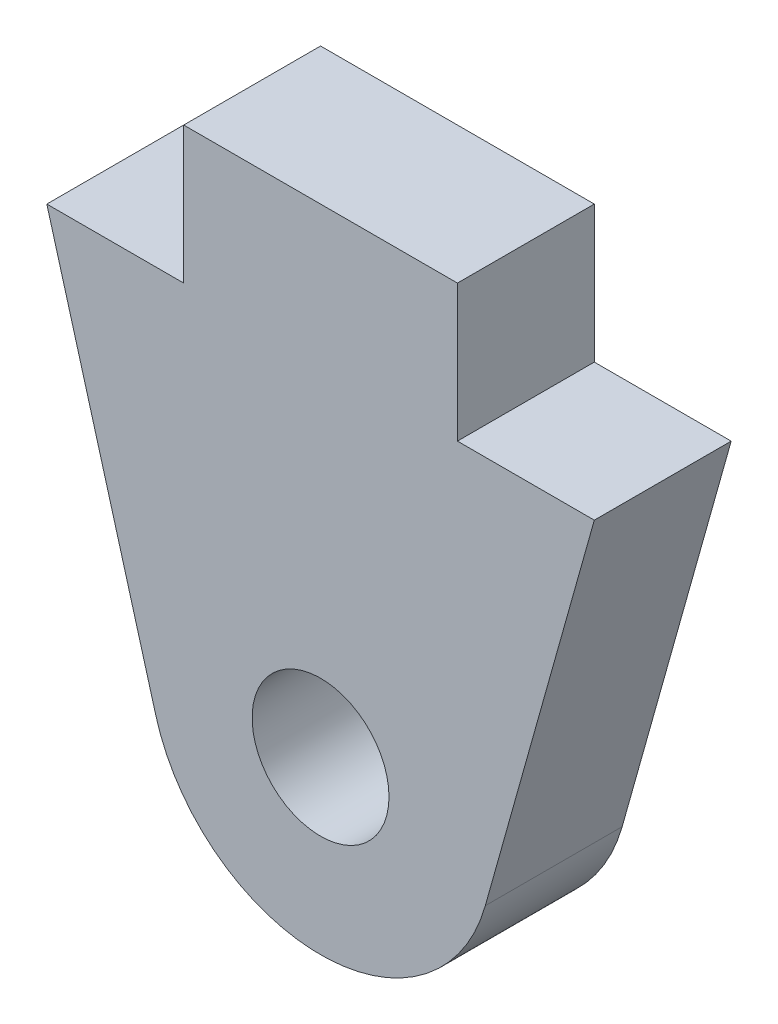
ISO-10303-21;
HEADER;
FILE_DESCRIPTION(('STEP AP214'),'2;1');
FILE_NAME('part.step','',(''),(''),'','','');
FILE_SCHEMA(('AUTOMOTIVE_DESIGN { 1 0 10303 214 1 1 1 1 }'));
ENDSEC;
DATA;
#1=APPLICATION_CONTEXT('core data for automotive mechanical design processes');
#2=APPLICATION_PROTOCOL_DEFINITION('international standard','automotive_design',2000,#1);
#3=PRODUCT_CONTEXT('',#1,'mechanical');
#4=PRODUCT('Part','Part','',(#3));
#5=PRODUCT_RELATED_PRODUCT_CATEGORY('part','',(#4));
#6=PRODUCT_DEFINITION_FORMATION('','',#4);
#7=PRODUCT_DEFINITION_CONTEXT('part definition',#1,'design');
#8=PRODUCT_DEFINITION('design','',#6,#7);
#9=PRODUCT_DEFINITION_SHAPE('','',#8);
#10=(LENGTH_UNIT() NAMED_UNIT(*) SI_UNIT(.MILLI.,.METRE.));
#11=(NAMED_UNIT(*) PLANE_ANGLE_UNIT() SI_UNIT($,.RADIAN.));
#12=(NAMED_UNIT(*) SI_UNIT($,.STERADIAN.) SOLID_ANGLE_UNIT());
#13=UNCERTAINTY_MEASURE_WITH_UNIT(LENGTH_MEASURE(1.E-05),#10,'distance_accuracy_value','');
#14=(GEOMETRIC_REPRESENTATION_CONTEXT(3) GLOBAL_UNCERTAINTY_ASSIGNED_CONTEXT((#13)) GLOBAL_UNIT_ASSIGNED_CONTEXT((#10,
#11,#12)) REPRESENTATION_CONTEXT('',''));
#15=CARTESIAN_POINT('',(0.,0.,0.));
#16=DIRECTION('',(0.,0.,1.));
#17=DIRECTION('',(1.,0.,0.));
#18=AXIS2_PLACEMENT_3D('',#15,#16,#17);
#19=CARTESIAN_POINT('',(-530.563255123357,-19.0499999999992,6.35));
#20=DIRECTION('',(0.,0.,-1.));
#21=DIRECTION('',(-1.,0.,0.));
#22=AXIS2_PLACEMENT_3D('',#19,#20,#21);
#23=PLANE('',#22);
#24=DIRECTION('',(0.,1.,0.));
#25=VECTOR('',#24,1.);
#26=CARTESIAN_POINT('',(-524.213255123357,3.17500000000006,6.35));
#27=LINE('',#26,#25);
#28=CARTESIAN_POINT('',(-524.213255123357,-3.17499999999994,6.35));
#29=VERTEX_POINT('',#28);
#30=CARTESIAN_POINT('',(-524.213255123357,3.17500000000006,6.35));
#31=VERTEX_POINT('',#30);
#32=EDGE_CURVE('E147',#29,#31,#27,.T.);
#33=ORIENTED_EDGE('',*,*,#32,.T.);
#34=DIRECTION('',(-1.,0.,0.));
#35=VECTOR('',#34,1.);
#36=CARTESIAN_POINT('',(-524.213255123357,3.17500000000006,6.35));
#37=LINE('',#36,#35);
#38=CARTESIAN_POINT('',(-536.913255123357,3.17500000000006,6.35));
#39=VERTEX_POINT('',#38);
#40=EDGE_CURVE('E95',#31,#39,#37,.T.);
#41=ORIENTED_EDGE('',*,*,#40,.T.);
#42=DIRECTION('',(0.,-1.,0.));
#43=VECTOR('',#42,1.);
#44=CARTESIAN_POINT('',(-536.913255123357,3.17500000000006,6.35));
#45=LINE('',#44,#43);
#46=CARTESIAN_POINT('',(-536.913255123357,-3.17499999999994,6.35));
#47=VERTEX_POINT('',#46);
#48=EDGE_CURVE('E162',#39,#47,#45,.T.);
#49=ORIENTED_EDGE('',*,*,#48,.T.);
#50=DIRECTION('',(-1.,0.,0.));
#51=VECTOR('',#50,1.);
#52=CARTESIAN_POINT('',(-536.913255123357,-3.17499999999994,6.35));
#53=LINE('',#52,#51);
#54=CARTESIAN_POINT('',(-543.263255123357,-3.17499999999994,6.35));
#55=VERTEX_POINT('',#54);
#56=EDGE_CURVE('E175',#47,#55,#53,.T.);
#57=ORIENTED_EDGE('',*,*,#56,.T.);
#58=DIRECTION('',(0.270235420612282,-0.962794275765339,0.));
#59=VECTOR('',#58,1.);
#60=CARTESIAN_POINT('',(-543.263255123357,-3.17499999999994,6.35));
#61=LINE('',#60,#59);
#62=CARTESIAN_POINT('',(-538.205434687244,-21.1949936511092,6.35));
#63=VERTEX_POINT('',#62);
#64=EDGE_CURVE('E114',#55,#63,#61,.T.);
#65=ORIENTED_EDGE('',*,*,#64,.T.);
#66=CARTESIAN_POINT('',(-530.563255123357,-19.0499999999992,6.35));
#67=DIRECTION('',(0.,0.,1.));
#68=DIRECTION('',(-1.,0.,0.));
#69=AXIS2_PLACEMENT_3D('',#66,#67,#68);
#70=CIRCLE('',#69,7.93749999999998);
#71=CARTESIAN_POINT('',(-522.92107555947,-21.1949936511092,6.35));
#72=VERTEX_POINT('',#71);
#73=EDGE_CURVE('E108',#63,#72,#70,.T.);
#74=ORIENTED_EDGE('',*,*,#73,.T.);
#75=DIRECTION('',(0.270235420612282,0.962794275765339,0.));
#76=VECTOR('',#75,1.);
#77=CARTESIAN_POINT('',(-517.863255123357,-3.17499999999994,6.35));
#78=LINE('',#77,#76);
#79=CARTESIAN_POINT('',(-517.863255123357,-3.17499999999994,6.35));
#80=VERTEX_POINT('',#79);
#81=EDGE_CURVE('E112',#72,#80,#78,.T.);
#82=ORIENTED_EDGE('',*,*,#81,.T.);
#83=DIRECTION('',(-1.,0.,0.));
#84=VECTOR('',#83,1.);
#85=CARTESIAN_POINT('',(-524.213255123357,-3.17499999999994,6.35));
#86=LINE('',#85,#84);
#87=EDGE_CURVE('E52',#80,#29,#86,.T.);
#88=ORIENTED_EDGE('',*,*,#87,.T.);
#89=EDGE_LOOP('',(#33,#41,#49,#57,#65,#74,#82,#88));
#90=FACE_BOUND('',#89,.T.);
#91=CARTESIAN_POINT('',(-530.563255123357,-19.0499999999992,6.35));
#92=DIRECTION('',(0.,0.,1.));
#93=DIRECTION('',(1.,0.,0.));
#94=AXIS2_PLACEMENT_3D('',#91,#92,#93);
#95=CIRCLE('',#94,3.17500000000008);
#96=CARTESIAN_POINT('',(-527.388255123357,-19.0499999999992,6.35));
#97=VERTEX_POINT('',#96);
#98=EDGE_CURVE('E136',#97,#97,#95,.T.);
#99=ORIENTED_EDGE('',*,*,#98,.F.);
#100=EDGE_LOOP('',(#99));
#101=FACE_BOUND('',#100,.T.);
#102=ADVANCED_FACE('F35',(#90,#101),#23,.F.);
#103=CARTESIAN_POINT('',(-530.563255123357,-19.0499999999992,0.));
#104=DIRECTION('',(0.,0.,-1.));
#105=DIRECTION('',(-1.,0.,0.));
#106=AXIS2_PLACEMENT_3D('',#103,#104,#105);
#107=PLANE('',#106);
#108=DIRECTION('',(0.,1.,0.));
#109=VECTOR('',#108,1.);
#110=CARTESIAN_POINT('',(-524.213255123357,3.17500000000006,0.));
#111=LINE('',#110,#109);
#112=CARTESIAN_POINT('',(-524.213255123357,-3.17499999999994,0.));
#113=VERTEX_POINT('',#112);
#114=CARTESIAN_POINT('',(-524.213255123357,3.17500000000006,0.));
#115=VERTEX_POINT('',#114);
#116=EDGE_CURVE('E132',#113,#115,#111,.T.);
#117=ORIENTED_EDGE('',*,*,#116,.F.);
#118=DIRECTION('',(-1.,0.,0.));
#119=VECTOR('',#118,1.);
#120=CARTESIAN_POINT('',(-524.213255123357,-3.17499999999994,0.));
#121=LINE('',#120,#119);
#122=CARTESIAN_POINT('',(-517.863255123357,-3.17499999999994,0.));
#123=VERTEX_POINT('',#122);
#124=EDGE_CURVE('E87',#123,#113,#121,.T.);
#125=ORIENTED_EDGE('',*,*,#124,.F.);
#126=DIRECTION('',(0.270235420612282,0.962794275765339,0.));
#127=VECTOR('',#126,1.);
#128=CARTESIAN_POINT('',(-517.863255123357,-3.17499999999994,0.));
#129=LINE('',#128,#127);
#130=CARTESIAN_POINT('',(-522.92107555947,-21.1949936511092,0.));
#131=VERTEX_POINT('',#130);
#132=EDGE_CURVE('E81',#131,#123,#129,.T.);
#133=ORIENTED_EDGE('',*,*,#132,.F.);
#134=CARTESIAN_POINT('',(-530.563255123357,-19.0499999999992,0.));
#135=DIRECTION('',(0.,0.,1.));
#136=DIRECTION('',(-1.,0.,0.));
#137=AXIS2_PLACEMENT_3D('',#134,#135,#136);
#138=CIRCLE('',#137,7.93749999999998);
#139=CARTESIAN_POINT('',(-538.205434687244,-21.1949936511092,0.));
#140=VERTEX_POINT('',#139);
#141=EDGE_CURVE('E122',#140,#131,#138,.T.);
#142=ORIENTED_EDGE('',*,*,#141,.F.);
#143=DIRECTION('',(0.270235420612282,-0.962794275765339,0.));
#144=VECTOR('',#143,1.);
#145=CARTESIAN_POINT('',(-543.263255123357,-3.17499999999994,0.));
#146=LINE('',#145,#144);
#147=CARTESIAN_POINT('',(-543.263255123357,-3.17499999999994,0.));
#148=VERTEX_POINT('',#147);
#149=EDGE_CURVE('E142',#148,#140,#146,.T.);
#150=ORIENTED_EDGE('',*,*,#149,.F.);
#151=DIRECTION('',(-1.,0.,0.));
#152=VECTOR('',#151,1.);
#153=CARTESIAN_POINT('',(-536.913255123357,-3.17499999999994,0.));
#154=LINE('',#153,#152);
#155=CARTESIAN_POINT('',(-536.913255123357,-3.17499999999994,0.));
#156=VERTEX_POINT('',#155);
#157=EDGE_CURVE('E140',#156,#148,#154,.T.);
#158=ORIENTED_EDGE('',*,*,#157,.F.);
#159=DIRECTION('',(0.,-1.,0.));
#160=VECTOR('',#159,1.);
#161=CARTESIAN_POINT('',(-536.913255123357,3.17500000000006,0.));
#162=LINE('',#161,#160);
#163=CARTESIAN_POINT('',(-536.913255123357,3.17500000000006,0.));
#164=VERTEX_POINT('',#163);
#165=EDGE_CURVE('E138',#164,#156,#162,.T.);
#166=ORIENTED_EDGE('',*,*,#165,.F.);
#167=DIRECTION('',(-1.,0.,0.));
#168=VECTOR('',#167,1.);
#169=CARTESIAN_POINT('',(-524.213255123357,3.17500000000006,0.));
#170=LINE('',#169,#168);
#171=EDGE_CURVE('E135',#115,#164,#170,.T.);
#172=ORIENTED_EDGE('',*,*,#171,.F.);
#173=EDGE_LOOP('',(#117,#125,#133,#142,#150,#158,#166,#172));
#174=FACE_BOUND('',#173,.T.);
#175=CARTESIAN_POINT('',(-530.563255123357,-19.0499999999992,0.));
#176=DIRECTION('',(0.,0.,1.));
#177=DIRECTION('',(1.,0.,0.));
#178=AXIS2_PLACEMENT_3D('',#175,#176,#177);
#179=CIRCLE('',#178,3.17500000000008);
#180=CARTESIAN_POINT('',(-527.388255123357,-19.0499999999992,0.));
#181=VERTEX_POINT('',#180);
#182=EDGE_CURVE('E181',#181,#181,#179,.T.);
#183=ORIENTED_EDGE('',*,*,#182,.T.);
#184=EDGE_LOOP('',(#183));
#185=FACE_BOUND('',#184,.T.);
#186=ADVANCED_FACE('F166',(#174,#185),#107,.T.);
#187=CARTESIAN_POINT('',(-524.213255123357,3.17500000000006,6.35));
#188=DIRECTION('',(-1.,0.,0.));
#189=DIRECTION('',(0.,0.,1.));
#190=AXIS2_PLACEMENT_3D('',#187,#188,#189);
#191=PLANE('',#190);
#192=ORIENTED_EDGE('',*,*,#116,.T.);
#193=DIRECTION('',(0.,0.,-1.));
#194=VECTOR('',#193,1.);
#195=CARTESIAN_POINT('',(-524.213255123357,3.17500000000006,6.35));
#196=LINE('',#195,#194);
#197=EDGE_CURVE('E11',#31,#115,#196,.T.);
#198=ORIENTED_EDGE('',*,*,#197,.F.);
#199=ORIENTED_EDGE('',*,*,#32,.F.);
#200=DIRECTION('',(0.,0.,-1.));
#201=VECTOR('',#200,1.);
#202=CARTESIAN_POINT('',(-524.213255123357,-3.17499999999994,6.35));
#203=LINE('',#202,#201);
#204=EDGE_CURVE('E128',#29,#113,#203,.T.);
#205=ORIENTED_EDGE('',*,*,#204,.T.);
#206=EDGE_LOOP('',(#192,#198,#199,#205));
#207=FACE_BOUND('',#206,.T.);
#208=ADVANCED_FACE('F37',(#207),#191,.F.);
#209=CARTESIAN_POINT('',(-524.213255123357,3.17500000000006,6.35));
#210=DIRECTION('',(0.,-1.,0.));
#211=DIRECTION('',(0.,0.,-1.));
#212=AXIS2_PLACEMENT_3D('',#209,#210,#211);
#213=PLANE('',#212);
#214=ORIENTED_EDGE('',*,*,#171,.T.);
#215=DIRECTION('',(0.,0.,-1.));
#216=VECTOR('',#215,1.);
#217=CARTESIAN_POINT('',(-536.913255123357,3.17500000000006,6.35));
#218=LINE('',#217,#216);
#219=EDGE_CURVE('E44',#39,#164,#218,.T.);
#220=ORIENTED_EDGE('',*,*,#219,.F.);
#221=ORIENTED_EDGE('',*,*,#40,.F.);
#222=ORIENTED_EDGE('',*,*,#197,.T.);
#223=EDGE_LOOP('',(#214,#220,#221,#222));
#224=FACE_BOUND('',#223,.T.);
#225=ADVANCED_FACE('F209',(#224),#213,.F.);
#226=CARTESIAN_POINT('',(-536.913255123357,3.17500000000006,6.35));
#227=DIRECTION('',(1.,0.,0.));
#228=DIRECTION('',(0.,0.,-1.));
#229=AXIS2_PLACEMENT_3D('',#226,#227,#228);
#230=PLANE('',#229);
#231=ORIENTED_EDGE('',*,*,#165,.T.);
#232=DIRECTION('',(0.,0.,-1.));
#233=VECTOR('',#232,1.);
#234=CARTESIAN_POINT('',(-536.913255123357,-3.17499999999994,6.35));
#235=LINE('',#234,#233);
#236=EDGE_CURVE('E154',#47,#156,#235,.T.);
#237=ORIENTED_EDGE('',*,*,#236,.F.);
#238=ORIENTED_EDGE('',*,*,#48,.F.);
#239=ORIENTED_EDGE('',*,*,#219,.T.);
#240=EDGE_LOOP('',(#231,#237,#238,#239));
#241=FACE_BOUND('',#240,.T.);
#242=ADVANCED_FACE('F160',(#241),#230,.F.);
#243=CARTESIAN_POINT('',(-536.913255123357,-3.17499999999994,6.35));
#244=DIRECTION('',(0.,-1.,0.));
#245=DIRECTION('',(1.,0.,0.));
#246=AXIS2_PLACEMENT_3D('',#243,#244,#245);
#247=PLANE('',#246);
#248=ORIENTED_EDGE('',*,*,#157,.T.);
#249=DIRECTION('',(0.,0.,-1.));
#250=VECTOR('',#249,1.);
#251=CARTESIAN_POINT('',(-543.263255123357,-3.17499999999994,6.35));
#252=LINE('',#251,#250);
#253=EDGE_CURVE('E151',#55,#148,#252,.T.);
#254=ORIENTED_EDGE('',*,*,#253,.F.);
#255=ORIENTED_EDGE('',*,*,#56,.F.);
#256=ORIENTED_EDGE('',*,*,#236,.T.);
#257=EDGE_LOOP('',(#248,#254,#255,#256));
#258=FACE_BOUND('',#257,.T.);
#259=ADVANCED_FACE('F171',(#258),#247,.F.);
#260=CARTESIAN_POINT('',(-543.263255123357,-3.17499999999994,6.35));
#261=DIRECTION('',(0.962794275765339,0.270235420612282,0.));
#262=DIRECTION('',(-0.270235420612282,0.962794275765339,0.));
#263=AXIS2_PLACEMENT_3D('',#260,#261,#262);
#264=PLANE('',#263);
#265=ORIENTED_EDGE('',*,*,#149,.T.);
#266=DIRECTION('',(0.,0.,-1.));
#267=VECTOR('',#266,1.);
#268=CARTESIAN_POINT('',(-538.205434687244,-21.1949936511092,6.35));
#269=LINE('',#268,#267);
#270=EDGE_CURVE('E123',#63,#140,#269,.T.);
#271=ORIENTED_EDGE('',*,*,#270,.F.);
#272=ORIENTED_EDGE('',*,*,#64,.F.);
#273=ORIENTED_EDGE('',*,*,#253,.T.);
#274=EDGE_LOOP('',(#265,#271,#272,#273));
#275=FACE_BOUND('',#274,.T.);
#276=ADVANCED_FACE('F174',(#275),#264,.F.);
#277=CARTESIAN_POINT('',(-530.563255123357,-19.0499999999992,6.35));
#278=DIRECTION('',(0.,0.,-1.));
#279=DIRECTION('',(-1.,0.,0.));
#280=AXIS2_PLACEMENT_3D('',#277,#278,#279);
#281=CYLINDRICAL_SURFACE('',#280,7.93749999999998);
#282=ORIENTED_EDGE('',*,*,#141,.T.);
#283=DIRECTION('',(0.,0.,-1.));
#284=VECTOR('',#283,1.);
#285=CARTESIAN_POINT('',(-522.92107555947,-21.1949936511092,6.35));
#286=LINE('',#285,#284);
#287=EDGE_CURVE('E119',#72,#131,#286,.T.);
#288=ORIENTED_EDGE('',*,*,#287,.F.);
#289=ORIENTED_EDGE('',*,*,#73,.F.);
#290=ORIENTED_EDGE('',*,*,#270,.T.);
#291=EDGE_LOOP('',(#282,#288,#289,#290));
#292=FACE_BOUND('',#291,.T.);
#293=ADVANCED_FACE('F120',(#292),#281,.T.);
#294=CARTESIAN_POINT('',(-517.863255123357,-3.17499999999994,6.35));
#295=DIRECTION('',(-0.962794275765339,0.270235420612282,0.));
#296=DIRECTION('',(-0.270235420612282,-0.962794275765339,0.));
#297=AXIS2_PLACEMENT_3D('',#294,#295,#296);
#298=PLANE('',#297);
#299=ORIENTED_EDGE('',*,*,#132,.T.);
#300=DIRECTION('',(0.,0.,-1.));
#301=VECTOR('',#300,1.);
#302=CARTESIAN_POINT('',(-517.863255123357,-3.17499999999994,6.35));
#303=LINE('',#302,#301);
#304=EDGE_CURVE('E124',#80,#123,#303,.T.);
#305=ORIENTED_EDGE('',*,*,#304,.F.);
#306=ORIENTED_EDGE('',*,*,#81,.F.);
#307=ORIENTED_EDGE('',*,*,#287,.T.);
#308=EDGE_LOOP('',(#299,#305,#306,#307));
#309=FACE_BOUND('',#308,.T.);
#310=ADVANCED_FACE('F126',(#309),#298,.F.);
#311=CARTESIAN_POINT('',(-524.213255123357,-3.17499999999994,6.35));
#312=DIRECTION('',(0.,-1.,0.));
#313=DIRECTION('',(1.,0.,0.));
#314=AXIS2_PLACEMENT_3D('',#311,#312,#313);
#315=PLANE('',#314);
#316=ORIENTED_EDGE('',*,*,#124,.T.);
#317=ORIENTED_EDGE('',*,*,#204,.F.);
#318=ORIENTED_EDGE('',*,*,#87,.F.);
#319=ORIENTED_EDGE('',*,*,#304,.T.);
#320=EDGE_LOOP('',(#316,#317,#318,#319));
#321=FACE_BOUND('',#320,.T.);
#322=ADVANCED_FACE('F197',(#321),#315,.F.);
#323=CARTESIAN_POINT('',(-530.563255123357,-19.0499999999992,6.35));
#324=DIRECTION('',(0.,0.,-1.));
#325=DIRECTION('',(-1.,0.,0.));
#326=AXIS2_PLACEMENT_3D('',#323,#324,#325);
#327=CYLINDRICAL_SURFACE('',#326,3.17500000000008);
#328=ORIENTED_EDGE('',*,*,#98,.T.);
#329=EDGE_LOOP('',(#328));
#330=FACE_BOUND('',#329,.T.);
#331=ORIENTED_EDGE('',*,*,#182,.F.);
#332=EDGE_LOOP('',(#331));
#333=FACE_BOUND('',#332,.T.);
#334=ADVANCED_FACE('F187',(#330,#333),#327,.F.);
#335=CLOSED_SHELL('',(#102,#186,#208,#225,#242,#259,#276,#293,#310,#322,#334));
#336=MANIFOLD_SOLID_BREP('B2',#335);
#337=ADVANCED_BREP_SHAPE_REPRESENTATION('',(#18,#336),#14);
#338=SHAPE_DEFINITION_REPRESENTATION(#9,#337);
ENDSEC;
END-ISO-10303-21;
